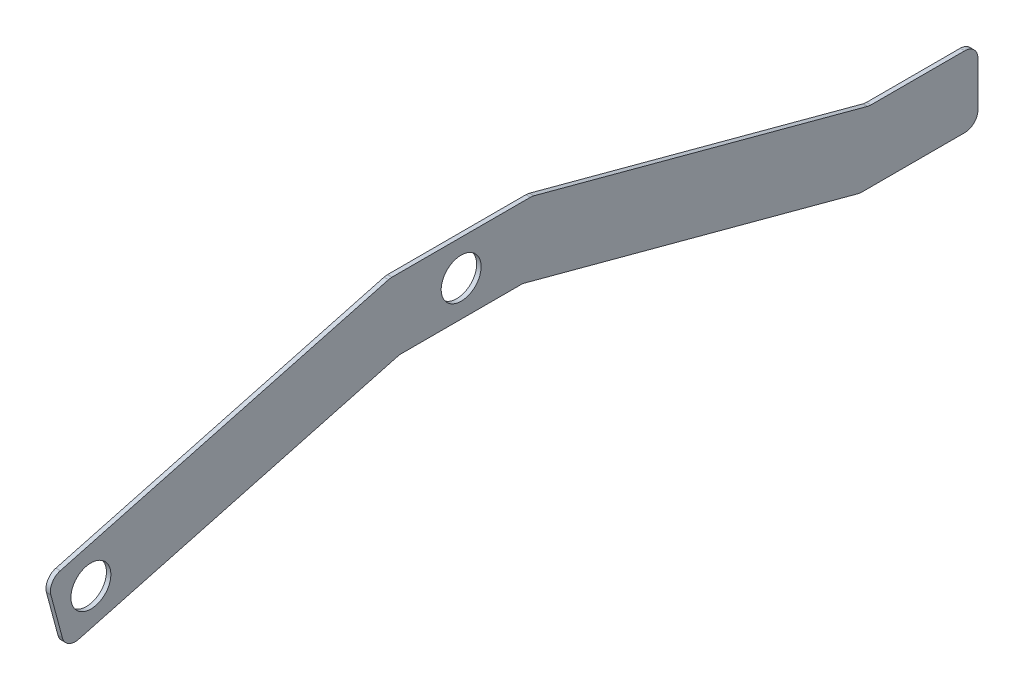
ISO-10303-21;
HEADER;
FILE_DESCRIPTION(('STEP AP214'),'2;1');
FILE_NAME('part.step','',(''),(''),'','','');
FILE_SCHEMA(('AUTOMOTIVE_DESIGN { 1 0 10303 214 1 1 1 1 }'));
ENDSEC;
DATA;
#1=APPLICATION_CONTEXT('core data for automotive mechanical design processes');
#2=APPLICATION_PROTOCOL_DEFINITION('international standard','automotive_design',2000,#1);
#3=PRODUCT_CONTEXT('',#1,'mechanical');
#4=PRODUCT('Part','Part','',(#3));
#5=PRODUCT_RELATED_PRODUCT_CATEGORY('part','',(#4));
#6=PRODUCT_DEFINITION_FORMATION('','',#4);
#7=PRODUCT_DEFINITION_CONTEXT('part definition',#1,'design');
#8=PRODUCT_DEFINITION('design','',#6,#7);
#9=PRODUCT_DEFINITION_SHAPE('','',#8);
#10=(LENGTH_UNIT() NAMED_UNIT(*) SI_UNIT(.MILLI.,.METRE.));
#11=(NAMED_UNIT(*) PLANE_ANGLE_UNIT() SI_UNIT($,.RADIAN.));
#12=(NAMED_UNIT(*) SI_UNIT($,.STERADIAN.) SOLID_ANGLE_UNIT());
#13=UNCERTAINTY_MEASURE_WITH_UNIT(LENGTH_MEASURE(1.E-05),#10,'distance_accuracy_value','');
#14=(GEOMETRIC_REPRESENTATION_CONTEXT(3) GLOBAL_UNCERTAINTY_ASSIGNED_CONTEXT((#13)) GLOBAL_UNIT_ASSIGNED_CONTEXT((#10,
#11,#12)) REPRESENTATION_CONTEXT('',''));
#15=CARTESIAN_POINT('',(0.,0.,0.));
#16=DIRECTION('',(0.,0.,1.));
#17=DIRECTION('',(1.,0.,0.));
#18=AXIS2_PLACEMENT_3D('',#15,#16,#17);
#19=CARTESIAN_POINT('',(3.175,0.,0.));
#20=DIRECTION('',(1.,0.,0.));
#21=DIRECTION('',(0.,0.,-1.));
#22=AXIS2_PLACEMENT_3D('',#19,#20,#21);
#23=PLANE('',#22);
#24=DIRECTION('',(0.,1.,0.));
#25=VECTOR('',#24,1.);
#26=CARTESIAN_POINT('',(3.175,-60.1195645269968,-369.963359855923));
#27=LINE('',#26,#25);
#28=CARTESIAN_POINT('',(3.175,-80.5255496981788,-369.963359855923));
#29=VERTEX_POINT('',#28);
#30=CARTESIAN_POINT('',(3.175,-48.7755496981788,-369.963359855923));
#31=VERTEX_POINT('',#30);
#32=EDGE_CURVE('E174',#29,#31,#27,.T.);
#33=ORIENTED_EDGE('',*,*,#32,.T.);
#34=CARTESIAN_POINT('',(3.175,-48.7755496981788,-360.438359855923));
#35=DIRECTION('',(1.,0.,0.));
#36=DIRECTION('',(0.,0.,-1.));
#37=AXIS2_PLACEMENT_3D('',#34,#35,#36);
#38=CIRCLE('',#37,9.525);
#39=CARTESIAN_POINT('',(3.175,-39.2505496981788,-360.438359855923));
#40=VERTEX_POINT('',#39);
#41=EDGE_CURVE('E181',#31,#40,#38,.T.);
#42=ORIENTED_EDGE('',*,*,#41,.T.);
#43=DIRECTION('',(0.,0.,1.));
#44=VECTOR('',#43,1.);
#45=CARTESIAN_POINT('',(3.175,-39.2505496981788,-292.079136210865));
#46=LINE('',#45,#44);
#47=CARTESIAN_POINT('',(3.175,-39.2505496981788,-293.333126250384));
#48=VERTEX_POINT('',#47);
#49=EDGE_CURVE('E356',#40,#48,#46,.T.);
#50=ORIENTED_EDGE('',*,*,#49,.T.);
#51=CARTESIAN_POINT('',(3.175,-29.7255496981788,-293.333126250384));
#52=DIRECTION('',(1.,0.,0.));
#53=DIRECTION('',(0.,0.,-1.));
#54=AXIS2_PLACEMENT_3D('',#51,#52,#53);
#55=CIRCLE('',#54,9.525);
#56=CARTESIAN_POINT('',(3.175,-38.9259931935822,-290.867874845783));
#57=VERTEX_POINT('',#56);
#58=EDGE_CURVE('E272',#48,#57,#55,.F.);
#59=ORIENTED_EDGE('',*,*,#58,.T.);
#60=DIRECTION('',(0.,0.258819045102516,0.965925826289069));
#61=VECTOR('',#60,1.);
#62=CARTESIAN_POINT('',(3.175,25.4,-50.8));
#63=LINE('',#62,#61);
#64=CARTESIAN_POINT('',(3.175,25.0754434954034,-52.0112613650816));
#65=VERTEX_POINT('',#64);
#66=EDGE_CURVE('E192',#57,#65,#63,.T.);
#67=ORIENTED_EDGE('',*,*,#66,.T.);
#68=CARTESIAN_POINT('',(3.175,15.875,-49.5460099604801));
#69=DIRECTION('',(1.,0.,0.));
#70=DIRECTION('',(0.,0.,-1.));
#71=AXIS2_PLACEMENT_3D('',#68,#69,#70);
#72=CIRCLE('',#71,9.525);
#73=CARTESIAN_POINT('',(3.175,25.4,-49.5460099604801));
#74=VERTEX_POINT('',#73);
#75=EDGE_CURVE('E213',#65,#74,#72,.T.);
#76=ORIENTED_EDGE('',*,*,#75,.T.);
#77=DIRECTION('',(0.,0.,1.));
#78=VECTOR('',#77,1.);
#79=CARTESIAN_POINT('',(3.175,25.4,50.8));
#80=LINE('',#79,#78);
#81=CARTESIAN_POINT('',(3.175,25.4,49.5460099604801));
#82=VERTEX_POINT('',#81);
#83=EDGE_CURVE('E198',#74,#82,#80,.T.);
#84=ORIENTED_EDGE('',*,*,#83,.T.);
#85=CARTESIAN_POINT('',(3.175,15.875,49.5460099604801));
#86=DIRECTION('',(1.,0.,0.));
#87=DIRECTION('',(0.,0.,-1.));
#88=AXIS2_PLACEMENT_3D('',#85,#86,#87);
#89=CIRCLE('',#88,9.525);
#90=CARTESIAN_POINT('',(3.175,25.0754434954034,52.0112613650816));
#91=VERTEX_POINT('',#90);
#92=EDGE_CURVE('E211',#82,#91,#89,.T.);
#93=ORIENTED_EDGE('',*,*,#92,.T.);
#94=DIRECTION('',(0.,-0.258819045102522,0.965925826289068));
#95=VECTOR('',#94,1.);
#96=CARTESIAN_POINT('',(3.175,-40.3400374560406,296.145159877423));
#97=LINE('',#96,#95);
#98=CARTESIAN_POINT('',(3.175,-37.874786051439,286.94471638202));
#99=VERTEX_POINT('',#98);
#100=EDGE_CURVE('E331',#91,#99,#97,.T.);
#101=ORIENTED_EDGE('',*,*,#100,.T.);
#102=CARTESIAN_POINT('',(3.175,-47.0752295468424,284.479464977418));
#103=DIRECTION('',(1.,0.,0.));
#104=DIRECTION('',(0.,0.,-1.));
#105=AXIS2_PLACEMENT_3D('',#102,#103,#104);
#106=CIRCLE('',#105,9.525);
#107=CARTESIAN_POINT('',(3.175,-49.5404809514439,293.679908472822));
#108=VERTEX_POINT('',#107);
#109=EDGE_CURVE('E200',#99,#108,#106,.T.);
#110=ORIENTED_EDGE('',*,*,#109,.T.);
#111=DIRECTION('',(0.,-0.965925826289068,-0.25881904510252));
#112=VECTOR('',#111,1.);
#113=CARTESIAN_POINT('',(3.175,-89.4090694315252,282.997152386215));
#114=LINE('',#113,#112);
#115=CARTESIAN_POINT('',(3.175,-80.2086259361218,285.462403790817));
#116=VERTEX_POINT('',#115);
#117=EDGE_CURVE('E311',#108,#116,#114,.T.);
#118=ORIENTED_EDGE('',*,*,#117,.T.);
#119=CARTESIAN_POINT('',(3.175,-77.7433745315203,276.261960295413));
#120=DIRECTION('',(1.,0.,0.));
#121=DIRECTION('',(0.,0.,-1.));
#122=AXIS2_PLACEMENT_3D('',#119,#120,#121);
#123=CIRCLE('',#122,9.525);
#124=CARTESIAN_POINT('',(3.175,-86.9438180269237,273.796708890812));
#125=VERTEX_POINT('',#124);
#126=EDGE_CURVE('E209',#116,#125,#123,.T.);
#127=ORIENTED_EDGE('',*,*,#126,.T.);
#128=DIRECTION('',(0.,0.258819045102522,-0.965925826289068));
#129=VECTOR('',#128,1.);
#130=CARTESIAN_POINT('',(3.175,-25.4,44.1120531225602));
#131=LINE('',#130,#129);
#132=CARTESIAN_POINT('',(3.175,-25.7245565045966,45.3233144876418));
#133=VERTEX_POINT('',#132);
#134=EDGE_CURVE('E304',#125,#133,#131,.T.);
#135=ORIENTED_EDGE('',*,*,#134,.T.);
#136=CARTESIAN_POINT('',(3.175,-34.925,42.8580630830402));
#137=DIRECTION('',(1.,0.,0.));
#138=DIRECTION('',(0.,0.,-1.));
#139=AXIS2_PLACEMENT_3D('',#136,#137,#138);
#140=CIRCLE('',#139,9.525);
#141=CARTESIAN_POINT('',(3.175,-25.4,42.8580630830402));
#142=VERTEX_POINT('',#141);
#143=EDGE_CURVE('E11',#133,#142,#140,.F.);
#144=ORIENTED_EDGE('',*,*,#143,.T.);
#145=DIRECTION('',(0.,0.,-1.));
#146=VECTOR('',#145,1.);
#147=CARTESIAN_POINT('',(3.175,-25.4,-44.1120531225602));
#148=LINE('',#147,#146);
#149=CARTESIAN_POINT('',(3.175,-25.4,-42.8580630830403));
#150=VERTEX_POINT('',#149);
#151=EDGE_CURVE('E302',#142,#150,#148,.T.);
#152=ORIENTED_EDGE('',*,*,#151,.T.);
#153=CARTESIAN_POINT('',(3.175,-34.925,-42.8580630830403));
#154=DIRECTION('',(1.,0.,0.));
#155=DIRECTION('',(0.,0.,-1.));
#156=AXIS2_PLACEMENT_3D('',#153,#154,#155);
#157=CIRCLE('',#156,9.525);
#158=CARTESIAN_POINT('',(3.175,-25.7245565045966,-45.3233144876418));
#159=VERTEX_POINT('',#158);
#160=EDGE_CURVE('E278',#150,#159,#157,.F.);
#161=ORIENTED_EDGE('',*,*,#160,.T.);
#162=DIRECTION('',(0.,-0.258819045102516,-0.965925826289069));
#163=VECTOR('',#162,1.);
#164=CARTESIAN_POINT('',(3.175,-99.0997755163283,-319.163359855923));
#165=LINE('',#164,#163);
#166=CARTESIAN_POINT('',(3.175,-89.7259931935822,-284.179927968343));
#167=VERTEX_POINT('',#166);
#168=EDGE_CURVE('E193',#159,#167,#165,.T.);
#169=ORIENTED_EDGE('',*,*,#168,.T.);
#170=CARTESIAN_POINT('',(3.175,-80.5255496981788,-286.645179372945));
#171=DIRECTION('',(1.,0.,0.));
#172=DIRECTION('',(0.,0.,-1.));
#173=AXIS2_PLACEMENT_3D('',#170,#171,#172);
#174=CIRCLE('',#173,9.525);
#175=CARTESIAN_POINT('',(3.175,-90.0505496981788,-286.645179372945));
#176=VERTEX_POINT('',#175);
#177=EDGE_CURVE('E182',#167,#176,#174,.T.);
#178=ORIENTED_EDGE('',*,*,#177,.T.);
#179=DIRECTION('',(0.,0.,1.));
#180=VECTOR('',#179,1.);
#181=CARTESIAN_POINT('',(3.175,-90.0505496981788,-319.163359855923));
#182=LINE('',#181,#180);
#183=CARTESIAN_POINT('',(3.175,-90.0505496981788,-360.438359855923));
#184=VERTEX_POINT('',#183);
#185=EDGE_CURVE('E176',#184,#176,#182,.T.);
#186=ORIENTED_EDGE('',*,*,#185,.F.);
#187=CARTESIAN_POINT('',(3.175,-80.5255496981788,-360.438359855923));
#188=DIRECTION('',(1.,0.,0.));
#189=DIRECTION('',(0.,0.,-1.));
#190=AXIS2_PLACEMENT_3D('',#187,#188,#189);
#191=CIRCLE('',#190,9.525);
#192=EDGE_CURVE('E171',#184,#29,#191,.T.);
#193=ORIENTED_EDGE('',*,*,#192,.T.);
#194=EDGE_LOOP('',(#33,#42,#50,#59,#67,#76,#84,#93,#101,#110,#118,#127,#135,#144,#152,#161,#169,
#178,#186,#193));
#195=FACE_BOUND('',#194,.T.);
#196=CARTESIAN_POINT('',(3.175,0.,0.));
#197=DIRECTION('',(1.,0.,0.));
#198=DIRECTION('',(0.,0.,-1.));
#199=AXIS2_PLACEMENT_3D('',#196,#197,#198);
#200=CIRCLE('',#199,14.2875);
#201=CARTESIAN_POINT('',(3.175,0.,-14.2875));
#202=VERTEX_POINT('',#201);
#203=EDGE_CURVE('E320',#202,#202,#200,.T.);
#204=ORIENTED_EDGE('',*,*,#203,.F.);
#205=EDGE_LOOP('',(#204));
#206=FACE_BOUND('',#205,.T.);
#207=CARTESIAN_POINT('',(3.175,-58.3005496981788,265.036640144077));
#208=DIRECTION('',(1.,0.,0.));
#209=DIRECTION('',(0.,0.,-1.));
#210=AXIS2_PLACEMENT_3D('',#207,#208,#209);
#211=CIRCLE('',#210,14.2875);
#212=CARTESIAN_POINT('',(3.175,-58.3005496981788,250.749140144077));
#213=VERTEX_POINT('',#212);
#214=EDGE_CURVE('E343',#213,#213,#211,.T.);
#215=ORIENTED_EDGE('',*,*,#214,.F.);
#216=EDGE_LOOP('',(#215));
#217=FACE_BOUND('',#216,.T.);
#218=ADVANCED_FACE('F34',(#195,#206,#217),#23,.T.);
#219=CARTESIAN_POINT('',(0.,0.,0.));
#220=DIRECTION('',(1.,0.,0.));
#221=DIRECTION('',(0.,0.,-1.));
#222=AXIS2_PLACEMENT_3D('',#219,#220,#221);
#223=PLANE('',#222);
#224=DIRECTION('',(0.,0.,1.));
#225=VECTOR('',#224,1.);
#226=CARTESIAN_POINT('',(0.,-39.2505496981788,-292.079136210865));
#227=LINE('',#226,#225);
#228=CARTESIAN_POINT('',(0.,-39.2505496981788,-360.438359855923));
#229=VERTEX_POINT('',#228);
#230=CARTESIAN_POINT('',(0.,-39.2505496981788,-293.333126250384));
#231=VERTEX_POINT('',#230);
#232=EDGE_CURVE('E353',#229,#231,#227,.T.);
#233=ORIENTED_EDGE('',*,*,#232,.F.);
#234=CARTESIAN_POINT('',(0.,-48.7755496981788,-360.438359855923));
#235=DIRECTION('',(1.,0.,0.));
#236=DIRECTION('',(0.,0.,-1.));
#237=AXIS2_PLACEMENT_3D('',#234,#235,#236);
#238=CIRCLE('',#237,9.525);
#239=CARTESIAN_POINT('',(0.,-48.7755496981788,-369.963359855923));
#240=VERTEX_POINT('',#239);
#241=EDGE_CURVE('E232',#229,#240,#238,.F.);
#242=ORIENTED_EDGE('',*,*,#241,.T.);
#243=DIRECTION('',(0.,1.,0.));
#244=VECTOR('',#243,1.);
#245=CARTESIAN_POINT('',(0.,-60.1195645269968,-369.963359855923));
#246=LINE('',#245,#244);
#247=CARTESIAN_POINT('',(0.,-80.5255496981788,-369.963359855923));
#248=VERTEX_POINT('',#247);
#249=EDGE_CURVE('E327',#248,#240,#246,.T.);
#250=ORIENTED_EDGE('',*,*,#249,.F.);
#251=CARTESIAN_POINT('',(0.,-80.5255496981788,-360.438359855923));
#252=DIRECTION('',(1.,0.,0.));
#253=DIRECTION('',(0.,0.,-1.));
#254=AXIS2_PLACEMENT_3D('',#251,#252,#253);
#255=CIRCLE('',#254,9.525);
#256=CARTESIAN_POINT('',(0.,-90.0505496981788,-360.438359855923));
#257=VERTEX_POINT('',#256);
#258=EDGE_CURVE('E197',#248,#257,#255,.F.);
#259=ORIENTED_EDGE('',*,*,#258,.T.);
#260=DIRECTION('',(0.,0.,1.));
#261=VECTOR('',#260,1.);
#262=CARTESIAN_POINT('',(0.,-90.0505496981788,-319.163359855923));
#263=LINE('',#262,#261);
#264=CARTESIAN_POINT('',(0.,-90.0505496981788,-286.645179372945));
#265=VERTEX_POINT('',#264);
#266=EDGE_CURVE('E349',#257,#265,#263,.T.);
#267=ORIENTED_EDGE('',*,*,#266,.T.);
#268=CARTESIAN_POINT('',(0.,-80.5255496981788,-286.645179372945));
#269=DIRECTION('',(1.,0.,0.));
#270=DIRECTION('',(0.,0.,-1.));
#271=AXIS2_PLACEMENT_3D('',#268,#269,#270);
#272=CIRCLE('',#271,9.525);
#273=CARTESIAN_POINT('',(0.,-89.7259931935822,-284.179927968343));
#274=VERTEX_POINT('',#273);
#275=EDGE_CURVE('E229',#265,#274,#272,.F.);
#276=ORIENTED_EDGE('',*,*,#275,.T.);
#277=DIRECTION('',(0.,-0.258819045102516,-0.965925826289069));
#278=VECTOR('',#277,1.);
#279=CARTESIAN_POINT('',(0.,-99.0997755163283,-319.163359855923));
#280=LINE('',#279,#278);
#281=CARTESIAN_POINT('',(0.,-25.7245565045966,-45.3233144876418));
#282=VERTEX_POINT('',#281);
#283=EDGE_CURVE('E324',#282,#274,#280,.T.);
#284=ORIENTED_EDGE('',*,*,#283,.F.);
#285=CARTESIAN_POINT('',(0.,-34.925,-42.8580630830403));
#286=DIRECTION('',(1.,0.,0.));
#287=DIRECTION('',(0.,0.,-1.));
#288=AXIS2_PLACEMENT_3D('',#285,#286,#287);
#289=CIRCLE('',#288,9.525);
#290=CARTESIAN_POINT('',(0.,-25.4,-42.8580630830403));
#291=VERTEX_POINT('',#290);
#292=EDGE_CURVE('E276',#282,#291,#289,.T.);
#293=ORIENTED_EDGE('',*,*,#292,.T.);
#294=DIRECTION('',(0.,0.,-1.));
#295=VECTOR('',#294,1.);
#296=CARTESIAN_POINT('',(0.,-25.4,-44.1120531225602));
#297=LINE('',#296,#295);
#298=CARTESIAN_POINT('',(0.,-25.4,42.8580630830402));
#299=VERTEX_POINT('',#298);
#300=EDGE_CURVE('E287',#299,#291,#297,.T.);
#301=ORIENTED_EDGE('',*,*,#300,.F.);
#302=CARTESIAN_POINT('',(0.,-34.925,42.8580630830402));
#303=DIRECTION('',(1.,0.,0.));
#304=DIRECTION('',(0.,0.,-1.));
#305=AXIS2_PLACEMENT_3D('',#302,#303,#304);
#306=CIRCLE('',#305,9.525);
#307=CARTESIAN_POINT('',(0.,-25.7245565045966,45.3233144876418));
#308=VERTEX_POINT('',#307);
#309=EDGE_CURVE('E42',#299,#308,#306,.T.);
#310=ORIENTED_EDGE('',*,*,#309,.T.);
#311=DIRECTION('',(0.,0.258819045102522,-0.965925826289068));
#312=VECTOR('',#311,1.);
#313=CARTESIAN_POINT('',(0.,-25.4,44.1120531225602));
#314=LINE('',#313,#312);
#315=CARTESIAN_POINT('',(0.,-86.9438180269237,273.796708890812));
#316=VERTEX_POINT('',#315);
#317=EDGE_CURVE('E285',#316,#308,#314,.T.);
#318=ORIENTED_EDGE('',*,*,#317,.F.);
#319=CARTESIAN_POINT('',(0.,-77.7433745315203,276.261960295413));
#320=DIRECTION('',(1.,0.,0.));
#321=DIRECTION('',(0.,0.,-1.));
#322=AXIS2_PLACEMENT_3D('',#319,#320,#321);
#323=CIRCLE('',#322,9.525);
#324=CARTESIAN_POINT('',(0.,-80.2086259361218,285.462403790817));
#325=VERTEX_POINT('',#324);
#326=EDGE_CURVE('E224',#316,#325,#323,.F.);
#327=ORIENTED_EDGE('',*,*,#326,.T.);
#328=DIRECTION('',(0.,-0.965925826289068,-0.25881904510252));
#329=VECTOR('',#328,1.);
#330=CARTESIAN_POINT('',(0.,-89.4090694315252,282.997152386215));
#331=LINE('',#330,#329);
#332=CARTESIAN_POINT('',(0.,-49.5404809514439,293.679908472822));
#333=VERTEX_POINT('',#332);
#334=EDGE_CURVE('E296',#333,#325,#331,.T.);
#335=ORIENTED_EDGE('',*,*,#334,.F.);
#336=CARTESIAN_POINT('',(0.,-47.0752295468424,284.479464977418));
#337=DIRECTION('',(1.,0.,0.));
#338=DIRECTION('',(0.,0.,-1.));
#339=AXIS2_PLACEMENT_3D('',#336,#337,#338);
#340=CIRCLE('',#339,9.525);
#341=CARTESIAN_POINT('',(0.,-37.874786051439,286.94471638202));
#342=VERTEX_POINT('',#341);
#343=EDGE_CURVE('E222',#333,#342,#340,.F.);
#344=ORIENTED_EDGE('',*,*,#343,.T.);
#345=DIRECTION('',(0.,-0.258819045102522,0.965925826289068));
#346=VECTOR('',#345,1.);
#347=CARTESIAN_POINT('',(0.,-40.3400374560406,296.145159877423));
#348=LINE('',#347,#346);
#349=CARTESIAN_POINT('',(0.,25.0754434954034,52.0112613650816));
#350=VERTEX_POINT('',#349);
#351=EDGE_CURVE('E317',#350,#342,#348,.T.);
#352=ORIENTED_EDGE('',*,*,#351,.F.);
#353=CARTESIAN_POINT('',(0.,15.875,49.5460099604801));
#354=DIRECTION('',(1.,0.,0.));
#355=DIRECTION('',(0.,0.,-1.));
#356=AXIS2_PLACEMENT_3D('',#353,#354,#355);
#357=CIRCLE('',#356,9.525);
#358=CARTESIAN_POINT('',(0.,25.4,49.5460099604801));
#359=VERTEX_POINT('',#358);
#360=EDGE_CURVE('E226',#350,#359,#357,.F.);
#361=ORIENTED_EDGE('',*,*,#360,.T.);
#362=DIRECTION('',(0.,0.,1.));
#363=VECTOR('',#362,1.);
#364=CARTESIAN_POINT('',(0.,25.4,50.8));
#365=LINE('',#364,#363);
#366=CARTESIAN_POINT('',(0.,25.4,-49.5460099604801));
#367=VERTEX_POINT('',#366);
#368=EDGE_CURVE('E205',#367,#359,#365,.T.);
#369=ORIENTED_EDGE('',*,*,#368,.F.);
#370=CARTESIAN_POINT('',(0.,15.875,-49.5460099604801));
#371=DIRECTION('',(1.,0.,0.));
#372=DIRECTION('',(0.,0.,-1.));
#373=AXIS2_PLACEMENT_3D('',#370,#371,#372);
#374=CIRCLE('',#373,9.525);
#375=CARTESIAN_POINT('',(0.,25.0754434954034,-52.0112613650816));
#376=VERTEX_POINT('',#375);
#377=EDGE_CURVE('E49',#367,#376,#374,.F.);
#378=ORIENTED_EDGE('',*,*,#377,.T.);
#379=DIRECTION('',(0.,0.258819045102516,0.965925826289069));
#380=VECTOR('',#379,1.);
#381=CARTESIAN_POINT('',(0.,25.4,-50.8));
#382=LINE('',#381,#380);
#383=CARTESIAN_POINT('',(0.,-38.9259931935822,-290.867874845783));
#384=VERTEX_POINT('',#383);
#385=EDGE_CURVE('E328',#384,#376,#382,.T.);
#386=ORIENTED_EDGE('',*,*,#385,.F.);
#387=CARTESIAN_POINT('',(0.,-29.7255496981788,-293.333126250384));
#388=DIRECTION('',(1.,0.,0.));
#389=DIRECTION('',(0.,0.,-1.));
#390=AXIS2_PLACEMENT_3D('',#387,#388,#389);
#391=CIRCLE('',#390,9.525);
#392=EDGE_CURVE('E274',#384,#231,#391,.T.);
#393=ORIENTED_EDGE('',*,*,#392,.T.);
#394=EDGE_LOOP('',(#233,#242,#250,#259,#267,#276,#284,#293,#301,#310,#318,#327,#335,#344,#352,
#361,#369,#378,#386,#393));
#395=FACE_BOUND('',#394,.T.);
#396=CARTESIAN_POINT('',(0.,0.,0.));
#397=DIRECTION('',(1.,0.,0.));
#398=DIRECTION('',(0.,0.,-1.));
#399=AXIS2_PLACEMENT_3D('',#396,#397,#398);
#400=CIRCLE('',#399,14.2875);
#401=CARTESIAN_POINT('',(0.,0.,-14.2875));
#402=VERTEX_POINT('',#401);
#403=EDGE_CURVE('E340',#402,#402,#400,.T.);
#404=ORIENTED_EDGE('',*,*,#403,.T.);
#405=EDGE_LOOP('',(#404));
#406=FACE_BOUND('',#405,.T.);
#407=CARTESIAN_POINT('',(0.,-58.3005496981788,265.036640144077));
#408=DIRECTION('',(1.,0.,0.));
#409=DIRECTION('',(0.,0.,-1.));
#410=AXIS2_PLACEMENT_3D('',#407,#408,#409);
#411=CIRCLE('',#410,14.2875);
#412=CARTESIAN_POINT('',(0.,-58.3005496981788,250.749140144077));
#413=VERTEX_POINT('',#412);
#414=EDGE_CURVE('E346',#413,#413,#411,.T.);
#415=ORIENTED_EDGE('',*,*,#414,.T.);
#416=EDGE_LOOP('',(#415));
#417=FACE_BOUND('',#416,.T.);
#418=ADVANCED_FACE('F283',(#395,#406,#417),#223,.F.);
#419=CARTESIAN_POINT('',(3.175,-40.3400374560406,296.145159877423));
#420=DIRECTION('',(0.,-0.965925826289068,-0.258819045102522));
#421=DIRECTION('',(0.,0.258819045102522,-0.965925826289068));
#422=AXIS2_PLACEMENT_3D('',#419,#420,#421);
#423=PLANE('',#422);
#424=ORIENTED_EDGE('',*,*,#100,.F.);
#425=DIRECTION('',(-1.,0.,0.));
#426=VECTOR('',#425,1.);
#427=CARTESIAN_POINT('',(3.175,25.0754434954034,52.0112613650816));
#428=LINE('',#427,#426);
#429=EDGE_CURVE('E264',#91,#350,#428,.T.);
#430=ORIENTED_EDGE('',*,*,#429,.T.);
#431=ORIENTED_EDGE('',*,*,#351,.T.);
#432=DIRECTION('',(-1.,0.,0.));
#433=VECTOR('',#432,1.);
#434=CARTESIAN_POINT('',(3.175,-37.874786051439,286.94471638202));
#435=LINE('',#434,#433);
#436=EDGE_CURVE('E262',#342,#99,#435,.F.);
#437=ORIENTED_EDGE('',*,*,#436,.T.);
#438=EDGE_LOOP('',(#424,#430,#431,#437));
#439=FACE_BOUND('',#438,.T.);
#440=ADVANCED_FACE('F381',(#439),#423,.F.);
#441=CARTESIAN_POINT('',(3.175,-89.4090694315252,282.997152386215));
#442=DIRECTION('',(0.,0.25881904510252,-0.965925826289068));
#443=DIRECTION('',(0.,0.965925826289069,0.25881904510252));
#444=AXIS2_PLACEMENT_3D('',#441,#442,#443);
#445=PLANE('',#444);
#446=ORIENTED_EDGE('',*,*,#334,.T.);
#447=DIRECTION('',(-1.,0.,0.));
#448=VECTOR('',#447,1.);
#449=CARTESIAN_POINT('',(3.175,-80.2086259361218,285.462403790817));
#450=LINE('',#449,#448);
#451=EDGE_CURVE('E270',#325,#116,#450,.F.);
#452=ORIENTED_EDGE('',*,*,#451,.T.);
#453=ORIENTED_EDGE('',*,*,#117,.F.);
#454=DIRECTION('',(-1.,0.,0.));
#455=VECTOR('',#454,1.);
#456=CARTESIAN_POINT('',(3.175,-49.5404809514439,293.679908472822));
#457=LINE('',#456,#455);
#458=EDGE_CURVE('E267',#108,#333,#457,.T.);
#459=ORIENTED_EDGE('',*,*,#458,.T.);
#460=EDGE_LOOP('',(#446,#452,#453,#459));
#461=FACE_BOUND('',#460,.T.);
#462=ADVANCED_FACE('F389',(#461),#445,.F.);
#463=CARTESIAN_POINT('',(3.175,-25.4,44.1120531225602));
#464=DIRECTION('',(0.,0.965925826289068,0.258819045102522));
#465=DIRECTION('',(0.,-0.258819045102522,0.965925826289068));
#466=AXIS2_PLACEMENT_3D('',#463,#464,#465);
#467=PLANE('',#466);
#468=ORIENTED_EDGE('',*,*,#317,.T.);
#469=DIRECTION('',(-1.,0.,0.));
#470=VECTOR('',#469,1.);
#471=CARTESIAN_POINT('',(3.175,-25.7245565045966,45.3233144876418));
#472=LINE('',#471,#470);
#473=EDGE_CURVE('E255',#308,#133,#472,.F.);
#474=ORIENTED_EDGE('',*,*,#473,.T.);
#475=ORIENTED_EDGE('',*,*,#134,.F.);
#476=DIRECTION('',(-1.,0.,0.));
#477=VECTOR('',#476,1.);
#478=CARTESIAN_POINT('',(3.175,-86.9438180269237,273.796708890812));
#479=LINE('',#478,#477);
#480=EDGE_CURVE('E252',#125,#316,#479,.T.);
#481=ORIENTED_EDGE('',*,*,#480,.T.);
#482=EDGE_LOOP('',(#468,#474,#475,#481));
#483=FACE_BOUND('',#482,.T.);
#484=ADVANCED_FACE('F292',(#483),#467,.F.);
#485=CARTESIAN_POINT('',(3.175,-25.4,-44.1120531225602));
#486=DIRECTION('',(0.,1.,0.));
#487=DIRECTION('',(0.,0.,1.));
#488=AXIS2_PLACEMENT_3D('',#485,#486,#487);
#489=PLANE('',#488);
#490=ORIENTED_EDGE('',*,*,#300,.T.);
#491=DIRECTION('',(-1.,0.,0.));
#492=VECTOR('',#491,1.);
#493=CARTESIAN_POINT('',(3.175,-25.4,-42.8580630830403));
#494=LINE('',#493,#492);
#495=EDGE_CURVE('E250',#291,#150,#494,.F.);
#496=ORIENTED_EDGE('',*,*,#495,.T.);
#497=ORIENTED_EDGE('',*,*,#151,.F.);
#498=DIRECTION('',(-1.,0.,0.));
#499=VECTOR('',#498,1.);
#500=CARTESIAN_POINT('',(0.,-25.4,42.8580630830402));
#501=LINE('',#500,#499);
#502=EDGE_CURVE('E247',#142,#299,#501,.T.);
#503=ORIENTED_EDGE('',*,*,#502,.T.);
#504=EDGE_LOOP('',(#490,#496,#497,#503));
#505=FACE_BOUND('',#504,.T.);
#506=ADVANCED_FACE('F306',(#505),#489,.F.);
#507=CARTESIAN_POINT('',(3.175,-99.0997755163283,-319.163359855923));
#508=DIRECTION('',(0.,0.965925826289069,-0.258819045102516));
#509=DIRECTION('',(0.,0.258819045102516,0.96592582628907));
#510=AXIS2_PLACEMENT_3D('',#507,#508,#509);
#511=PLANE('',#510);
#512=ORIENTED_EDGE('',*,*,#283,.T.);
#513=DIRECTION('',(1.,0.,0.));
#514=VECTOR('',#513,1.);
#515=CARTESIAN_POINT('',(3.175,-89.7259931935822,-284.179927968343));
#516=LINE('',#515,#514);
#517=EDGE_CURVE('E241',#274,#167,#516,.T.);
#518=ORIENTED_EDGE('',*,*,#517,.T.);
#519=ORIENTED_EDGE('',*,*,#168,.F.);
#520=DIRECTION('',(-1.,0.,0.));
#521=VECTOR('',#520,1.);
#522=CARTESIAN_POINT('',(0.,-25.7245565045966,-45.3233144876418));
#523=LINE('',#522,#521);
#524=EDGE_CURVE('E238',#159,#282,#523,.T.);
#525=ORIENTED_EDGE('',*,*,#524,.T.);
#526=EDGE_LOOP('',(#512,#518,#519,#525));
#527=FACE_BOUND('',#526,.T.);
#528=ADVANCED_FACE('F416',(#527),#511,.F.);
#529=CARTESIAN_POINT('',(3.175,-60.1195645269968,-369.963359855923));
#530=DIRECTION('',(0.,0.,1.));
#531=DIRECTION('',(1.,0.,0.));
#532=AXIS2_PLACEMENT_3D('',#529,#530,#531);
#533=PLANE('',#532);
#534=ORIENTED_EDGE('',*,*,#249,.T.);
#535=DIRECTION('',(1.,0.,0.));
#536=VECTOR('',#535,1.);
#537=CARTESIAN_POINT('',(3.175,-48.7755496981788,-369.963359855923));
#538=LINE('',#537,#536);
#539=EDGE_CURVE('E191',#240,#31,#538,.T.);
#540=ORIENTED_EDGE('',*,*,#539,.T.);
#541=ORIENTED_EDGE('',*,*,#32,.F.);
#542=DIRECTION('',(1.,0.,0.));
#543=VECTOR('',#542,1.);
#544=CARTESIAN_POINT('',(3.175,-80.5255496981788,-369.963359855923));
#545=LINE('',#544,#543);
#546=EDGE_CURVE('E188',#29,#248,#545,.F.);
#547=ORIENTED_EDGE('',*,*,#546,.T.);
#548=EDGE_LOOP('',(#534,#540,#541,#547));
#549=FACE_BOUND('',#548,.T.);
#550=ADVANCED_FACE('F187',(#549),#533,.F.);
#551=CARTESIAN_POINT('',(3.175,25.4,-50.8));
#552=DIRECTION('',(0.,-0.965925826289069,0.258819045102516));
#553=DIRECTION('',(0.,-0.258819045102516,-0.965925826289069));
#554=AXIS2_PLACEMENT_3D('',#551,#552,#553);
#555=PLANE('',#554);
#556=ORIENTED_EDGE('',*,*,#66,.F.);
#557=DIRECTION('',(1.,0.,0.));
#558=VECTOR('',#557,1.);
#559=CARTESIAN_POINT('',(3.175,-38.9259931935822,-290.867874845783));
#560=LINE('',#559,#558);
#561=EDGE_CURVE('E56',#57,#384,#560,.F.);
#562=ORIENTED_EDGE('',*,*,#561,.T.);
#563=ORIENTED_EDGE('',*,*,#385,.T.);
#564=DIRECTION('',(-1.,0.,0.));
#565=VECTOR('',#564,1.);
#566=CARTESIAN_POINT('',(3.175,25.0754434954034,-52.0112613650816));
#567=LINE('',#566,#565);
#568=EDGE_CURVE('E244',#376,#65,#567,.F.);
#569=ORIENTED_EDGE('',*,*,#568,.T.);
#570=EDGE_LOOP('',(#556,#562,#563,#569));
#571=FACE_BOUND('',#570,.T.);
#572=ADVANCED_FACE('F370',(#571),#555,.F.);
#573=CARTESIAN_POINT('',(3.175,25.4,50.8));
#574=DIRECTION('',(0.,-1.,0.));
#575=DIRECTION('',(0.,0.,-1.));
#576=AXIS2_PLACEMENT_3D('',#573,#574,#575);
#577=PLANE('',#576);
#578=ORIENTED_EDGE('',*,*,#83,.F.);
#579=DIRECTION('',(-1.,0.,0.));
#580=VECTOR('',#579,1.);
#581=CARTESIAN_POINT('',(3.175,25.4,-49.5460099604801));
#582=LINE('',#581,#580);
#583=EDGE_CURVE('E259',#74,#367,#582,.T.);
#584=ORIENTED_EDGE('',*,*,#583,.T.);
#585=ORIENTED_EDGE('',*,*,#368,.T.);
#586=DIRECTION('',(-1.,0.,0.));
#587=VECTOR('',#586,1.);
#588=CARTESIAN_POINT('',(3.175,25.4,49.5460099604801));
#589=LINE('',#588,#587);
#590=EDGE_CURVE('E257',#359,#82,#589,.F.);
#591=ORIENTED_EDGE('',*,*,#590,.T.);
#592=EDGE_LOOP('',(#578,#584,#585,#591));
#593=FACE_BOUND('',#592,.T.);
#594=ADVANCED_FACE('F376',(#593),#577,.F.);
#595=CARTESIAN_POINT('',(3.175,0.,0.));
#596=DIRECTION('',(-1.,0.,0.));
#597=DIRECTION('',(0.,0.,1.));
#598=AXIS2_PLACEMENT_3D('',#595,#596,#597);
#599=CYLINDRICAL_SURFACE('',#598,14.2875);
#600=ORIENTED_EDGE('',*,*,#203,.T.);
#601=EDGE_LOOP('',(#600));
#602=FACE_BOUND('',#601,.T.);
#603=ORIENTED_EDGE('',*,*,#403,.F.);
#604=EDGE_LOOP('',(#603));
#605=FACE_BOUND('',#604,.T.);
#606=ADVANCED_FACE('F407',(#602,#605),#599,.F.);
#607=CARTESIAN_POINT('',(3.175,-58.3005496981788,265.036640144077));
#608=DIRECTION('',(-1.,0.,0.));
#609=DIRECTION('',(0.,0.,1.));
#610=AXIS2_PLACEMENT_3D('',#607,#608,#609);
#611=CYLINDRICAL_SURFACE('',#610,14.2875);
#612=ORIENTED_EDGE('',*,*,#214,.T.);
#613=EDGE_LOOP('',(#612));
#614=FACE_BOUND('',#613,.T.);
#615=ORIENTED_EDGE('',*,*,#414,.F.);
#616=EDGE_LOOP('',(#615));
#617=FACE_BOUND('',#616,.T.);
#618=ADVANCED_FACE('F544',(#614,#617),#611,.F.);
#619=CARTESIAN_POINT('',(0.,-90.0505496981788,-319.163359855923));
#620=DIRECTION('',(0.,1.,0.));
#621=DIRECTION('',(0.,0.,1.));
#622=AXIS2_PLACEMENT_3D('',#619,#620,#621);
#623=PLANE('',#622);
#624=ORIENTED_EDGE('',*,*,#266,.F.);
#625=DIRECTION('',(1.,0.,0.));
#626=VECTOR('',#625,1.);
#627=CARTESIAN_POINT('',(0.,-90.0505496981788,-360.438359855923));
#628=LINE('',#627,#626);
#629=EDGE_CURVE('E236',#257,#184,#628,.T.);
#630=ORIENTED_EDGE('',*,*,#629,.T.);
#631=ORIENTED_EDGE('',*,*,#185,.T.);
#632=DIRECTION('',(1.,0.,0.));
#633=VECTOR('',#632,1.);
#634=CARTESIAN_POINT('',(0.,-90.0505496981788,-286.645179372945));
#635=LINE('',#634,#633);
#636=EDGE_CURVE('E234',#176,#265,#635,.F.);
#637=ORIENTED_EDGE('',*,*,#636,.T.);
#638=EDGE_LOOP('',(#624,#630,#631,#637));
#639=FACE_BOUND('',#638,.T.);
#640=ADVANCED_FACE('F506',(#639),#623,.F.);
#641=CARTESIAN_POINT('',(0.,-39.2505496981788,-292.079136210865));
#642=DIRECTION('',(0.,1.,0.));
#643=DIRECTION('',(0.,0.,1.));
#644=AXIS2_PLACEMENT_3D('',#641,#642,#643);
#645=PLANE('',#644);
#646=ORIENTED_EDGE('',*,*,#49,.F.);
#647=DIRECTION('',(1.,0.,0.));
#648=VECTOR('',#647,1.);
#649=CARTESIAN_POINT('',(0.,-39.2505496981788,-360.438359855923));
#650=LINE('',#649,#648);
#651=EDGE_CURVE('E220',#40,#229,#650,.F.);
#652=ORIENTED_EDGE('',*,*,#651,.T.);
#653=ORIENTED_EDGE('',*,*,#232,.T.);
#654=DIRECTION('',(1.,0.,0.));
#655=VECTOR('',#654,1.);
#656=CARTESIAN_POINT('',(0.,-39.2505496981788,-293.333126250384));
#657=LINE('',#656,#655);
#658=EDGE_CURVE('E217',#231,#48,#657,.T.);
#659=ORIENTED_EDGE('',*,*,#658,.T.);
#660=EDGE_LOOP('',(#646,#652,#653,#659));
#661=FACE_BOUND('',#660,.T.);
#662=ADVANCED_FACE('F363',(#661),#645,.T.);
#663=CARTESIAN_POINT('',(3.175,-48.7755496981788,-360.438359855923));
#664=DIRECTION('',(-1.,0.,0.));
#665=DIRECTION('',(0.,0.,1.));
#666=AXIS2_PLACEMENT_3D('',#663,#664,#665);
#667=CYLINDRICAL_SURFACE('',#666,9.525);
#668=ORIENTED_EDGE('',*,*,#241,.F.);
#669=ORIENTED_EDGE('',*,*,#651,.F.);
#670=ORIENTED_EDGE('',*,*,#41,.F.);
#671=ORIENTED_EDGE('',*,*,#539,.F.);
#672=EDGE_LOOP('',(#668,#669,#670,#671));
#673=FACE_BOUND('',#672,.T.);
#674=ADVANCED_FACE('F428',(#673),#667,.T.);
#675=CARTESIAN_POINT('',(0.,-80.5255496981788,-360.438359855923));
#676=DIRECTION('',(1.,0.,0.));
#677=DIRECTION('',(0.,0.,-1.));
#678=AXIS2_PLACEMENT_3D('',#675,#676,#677);
#679=CYLINDRICAL_SURFACE('',#678,9.525);
#680=ORIENTED_EDGE('',*,*,#258,.F.);
#681=ORIENTED_EDGE('',*,*,#546,.F.);
#682=ORIENTED_EDGE('',*,*,#192,.F.);
#683=ORIENTED_EDGE('',*,*,#629,.F.);
#684=EDGE_LOOP('',(#680,#681,#682,#683));
#685=FACE_BOUND('',#684,.T.);
#686=ADVANCED_FACE('F196',(#685),#679,.T.);
#687=CARTESIAN_POINT('',(3.175,-80.5255496981788,-286.645179372945));
#688=DIRECTION('',(1.,0.,0.));
#689=DIRECTION('',(0.,0.,-1.));
#690=AXIS2_PLACEMENT_3D('',#687,#688,#689);
#691=CYLINDRICAL_SURFACE('',#690,9.525);
#692=ORIENTED_EDGE('',*,*,#275,.F.);
#693=ORIENTED_EDGE('',*,*,#636,.F.);
#694=ORIENTED_EDGE('',*,*,#177,.F.);
#695=ORIENTED_EDGE('',*,*,#517,.F.);
#696=EDGE_LOOP('',(#692,#693,#694,#695));
#697=FACE_BOUND('',#696,.T.);
#698=ADVANCED_FACE('F434',(#697),#691,.T.);
#699=CARTESIAN_POINT('',(0.,-29.7255496981788,-293.333126250384));
#700=DIRECTION('',(1.,0.,0.));
#701=DIRECTION('',(0.,0.,-1.));
#702=AXIS2_PLACEMENT_3D('',#699,#700,#701);
#703=CYLINDRICAL_SURFACE('',#702,9.525);
#704=ORIENTED_EDGE('',*,*,#392,.F.);
#705=ORIENTED_EDGE('',*,*,#561,.F.);
#706=ORIENTED_EDGE('',*,*,#58,.F.);
#707=ORIENTED_EDGE('',*,*,#658,.F.);
#708=EDGE_LOOP('',(#704,#705,#706,#707));
#709=FACE_BOUND('',#708,.T.);
#710=ADVANCED_FACE('F368',(#709),#703,.F.);
#711=CARTESIAN_POINT('',(3.175,-34.925,-42.8580630830403));
#712=DIRECTION('',(1.,0.,0.));
#713=DIRECTION('',(0.,0.,-1.));
#714=AXIS2_PLACEMENT_3D('',#711,#712,#713);
#715=CYLINDRICAL_SURFACE('',#714,9.525);
#716=ORIENTED_EDGE('',*,*,#160,.F.);
#717=ORIENTED_EDGE('',*,*,#495,.F.);
#718=ORIENTED_EDGE('',*,*,#292,.F.);
#719=ORIENTED_EDGE('',*,*,#524,.F.);
#720=EDGE_LOOP('',(#716,#717,#718,#719));
#721=FACE_BOUND('',#720,.T.);
#722=ADVANCED_FACE('F440',(#721),#715,.F.);
#723=CARTESIAN_POINT('',(3.175,-34.925,42.8580630830402));
#724=DIRECTION('',(1.,0.,0.));
#725=DIRECTION('',(0.,0.,-1.));
#726=AXIS2_PLACEMENT_3D('',#723,#724,#725);
#727=CYLINDRICAL_SURFACE('',#726,9.525);
#728=ORIENTED_EDGE('',*,*,#143,.F.);
#729=ORIENTED_EDGE('',*,*,#473,.F.);
#730=ORIENTED_EDGE('',*,*,#309,.F.);
#731=ORIENTED_EDGE('',*,*,#502,.F.);
#732=EDGE_LOOP('',(#728,#729,#730,#731));
#733=FACE_BOUND('',#732,.T.);
#734=ADVANCED_FACE('F299',(#733),#727,.F.);
#735=CARTESIAN_POINT('',(3.175,15.875,-49.5460099604801));
#736=DIRECTION('',(-1.,0.,0.));
#737=DIRECTION('',(0.,0.,1.));
#738=AXIS2_PLACEMENT_3D('',#735,#736,#737);
#739=CYLINDRICAL_SURFACE('',#738,9.525);
#740=ORIENTED_EDGE('',*,*,#75,.F.);
#741=ORIENTED_EDGE('',*,*,#568,.F.);
#742=ORIENTED_EDGE('',*,*,#377,.F.);
#743=ORIENTED_EDGE('',*,*,#583,.F.);
#744=EDGE_LOOP('',(#740,#741,#742,#743));
#745=FACE_BOUND('',#744,.T.);
#746=ADVANCED_FACE('F372',(#745),#739,.T.);
#747=CARTESIAN_POINT('',(3.175,15.875,49.5460099604801));
#748=DIRECTION('',(-1.,0.,0.));
#749=DIRECTION('',(0.,0.,1.));
#750=AXIS2_PLACEMENT_3D('',#747,#748,#749);
#751=CYLINDRICAL_SURFACE('',#750,9.525);
#752=ORIENTED_EDGE('',*,*,#92,.F.);
#753=ORIENTED_EDGE('',*,*,#590,.F.);
#754=ORIENTED_EDGE('',*,*,#360,.F.);
#755=ORIENTED_EDGE('',*,*,#429,.F.);
#756=EDGE_LOOP('',(#752,#753,#754,#755));
#757=FACE_BOUND('',#756,.T.);
#758=ADVANCED_FACE('F378',(#757),#751,.T.);
#759=CARTESIAN_POINT('',(3.175,-77.7433745315203,276.261960295413));
#760=DIRECTION('',(-1.,0.,0.));
#761=DIRECTION('',(0.,0.,1.));
#762=AXIS2_PLACEMENT_3D('',#759,#760,#761);
#763=CYLINDRICAL_SURFACE('',#762,9.525);
#764=ORIENTED_EDGE('',*,*,#126,.F.);
#765=ORIENTED_EDGE('',*,*,#451,.F.);
#766=ORIENTED_EDGE('',*,*,#326,.F.);
#767=ORIENTED_EDGE('',*,*,#480,.F.);
#768=EDGE_LOOP('',(#764,#765,#766,#767));
#769=FACE_BOUND('',#768,.T.);
#770=ADVANCED_FACE('F393',(#769),#763,.T.);
#771=CARTESIAN_POINT('',(3.175,-47.0752295468424,284.479464977418));
#772=DIRECTION('',(-1.,0.,0.));
#773=DIRECTION('',(0.,0.,1.));
#774=AXIS2_PLACEMENT_3D('',#771,#772,#773);
#775=CYLINDRICAL_SURFACE('',#774,9.525);
#776=ORIENTED_EDGE('',*,*,#109,.F.);
#777=ORIENTED_EDGE('',*,*,#436,.F.);
#778=ORIENTED_EDGE('',*,*,#343,.F.);
#779=ORIENTED_EDGE('',*,*,#458,.F.);
#780=EDGE_LOOP('',(#776,#777,#778,#779));
#781=FACE_BOUND('',#780,.T.);
#782=ADVANCED_FACE('F36',(#781),#775,.T.);
#783=CLOSED_SHELL('',(#218,#418,#440,#462,#484,#506,#528,#550,#572,#594,#606,#618,#640,#662,
#674,#686,#698,#710,#722,#734,#746,#758,#770,#782));
#784=MANIFOLD_SOLID_BREP('B2',#783);
#785=ADVANCED_BREP_SHAPE_REPRESENTATION('',(#18,#784),#14);
#786=SHAPE_DEFINITION_REPRESENTATION(#9,#785);
ENDSEC;
END-ISO-10303-21;
